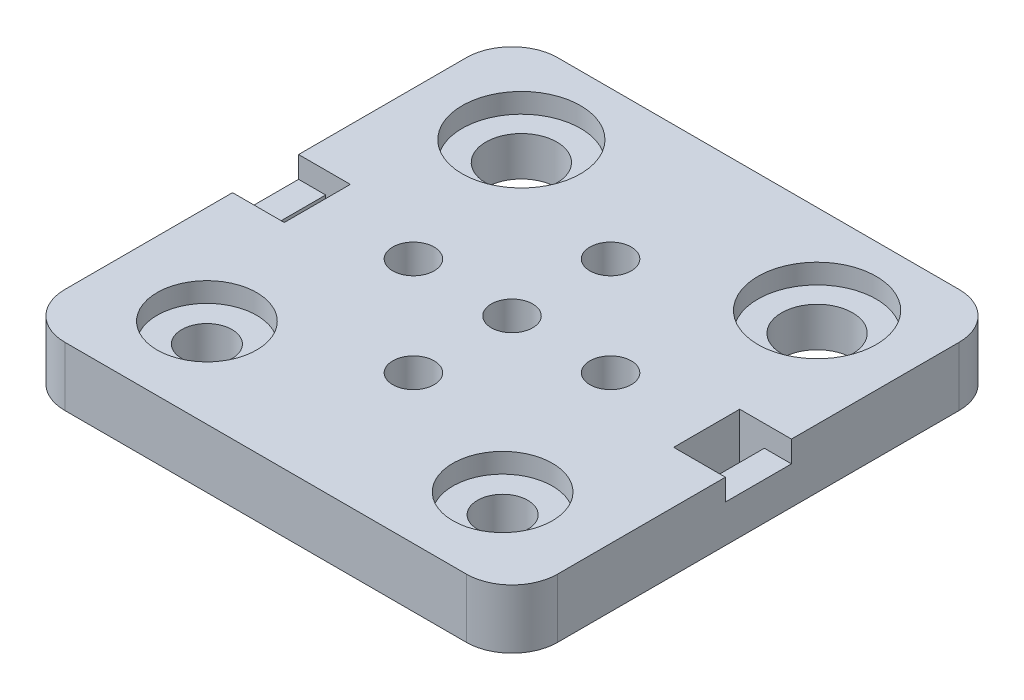
ISO-10303-21;
HEADER;
FILE_DESCRIPTION(('STEP AP214'),'2;1');
FILE_NAME('part.step','',(''),(''),'','','');
FILE_SCHEMA(('AUTOMOTIVE_DESIGN { 1 0 10303 214 1 1 1 1 }'));
ENDSEC;
DATA;
#1=APPLICATION_CONTEXT('core data for automotive mechanical design processes');
#2=APPLICATION_PROTOCOL_DEFINITION('international standard','automotive_design',2000,#1);
#3=PRODUCT_CONTEXT('',#1,'mechanical');
#4=PRODUCT('Part','Part','',(#3));
#5=PRODUCT_RELATED_PRODUCT_CATEGORY('part','',(#4));
#6=PRODUCT_DEFINITION_FORMATION('','',#4);
#7=PRODUCT_DEFINITION_CONTEXT('part definition',#1,'design');
#8=PRODUCT_DEFINITION('design','',#6,#7);
#9=PRODUCT_DEFINITION_SHAPE('','',#8);
#10=(LENGTH_UNIT() NAMED_UNIT(*) SI_UNIT(.MILLI.,.METRE.));
#11=(NAMED_UNIT(*) PLANE_ANGLE_UNIT() SI_UNIT($,.RADIAN.));
#12=(NAMED_UNIT(*) SI_UNIT($,.STERADIAN.) SOLID_ANGLE_UNIT());
#13=UNCERTAINTY_MEASURE_WITH_UNIT(LENGTH_MEASURE(1.E-05),#10,'distance_accuracy_value','');
#14=(GEOMETRIC_REPRESENTATION_CONTEXT(3) GLOBAL_UNCERTAINTY_ASSIGNED_CONTEXT((#13)) GLOBAL_UNIT_ASSIGNED_CONTEXT((#10,
#11,#12)) REPRESENTATION_CONTEXT('',''));
#15=CARTESIAN_POINT('',(0.,0.,0.));
#16=DIRECTION('',(0.,0.,1.));
#17=DIRECTION('',(1.,0.,0.));
#18=AXIS2_PLACEMENT_3D('',#15,#16,#17);
#19=CARTESIAN_POINT('',(-15.,6.,15.95));
#20=DIRECTION('',(0.,-1.,0.));
#21=DIRECTION('',(0.,0.,-1.));
#22=AXIS2_PLACEMENT_3D('',#19,#20,#21);
#23=CYLINDRICAL_SURFACE('',#22,2.55);
#24=CARTESIAN_POINT('',(-15.,0.,15.95));
#25=DIRECTION('',(0.,1.,0.));
#26=DIRECTION('',(0.,0.,-1.));
#27=AXIS2_PLACEMENT_3D('',#24,#25,#26);
#28=CIRCLE('',#27,2.55);
#29=CARTESIAN_POINT('',(-15.,0.,13.4));
#30=VERTEX_POINT('',#29);
#31=EDGE_CURVE('E332',#30,#30,#28,.T.);
#32=ORIENTED_EDGE('',*,*,#31,.F.);
#33=EDGE_LOOP('',(#32));
#34=FACE_BOUND('',#33,.T.);
#35=CARTESIAN_POINT('',(-15.,4.,15.95));
#36=DIRECTION('',(0.,1.,0.));
#37=DIRECTION('',(0.,0.,1.));
#38=AXIS2_PLACEMENT_3D('',#35,#36,#37);
#39=CIRCLE('',#38,2.55);
#40=CARTESIAN_POINT('',(-15.,4.,18.5));
#41=VERTEX_POINT('',#40);
#42=EDGE_CURVE('E47',#41,#41,#39,.T.);
#43=ORIENTED_EDGE('',*,*,#42,.T.);
#44=EDGE_LOOP('',(#43));
#45=FACE_BOUND('',#44,.T.);
#46=ADVANCED_FACE('F43',(#34,#45),#23,.F.);
#47=CARTESIAN_POINT('',(15.,6.,15.95));
#48=DIRECTION('',(0.,-1.,0.));
#49=DIRECTION('',(0.,0.,-1.));
#50=AXIS2_PLACEMENT_3D('',#47,#48,#49);
#51=CYLINDRICAL_SURFACE('',#50,2.55);
#52=CARTESIAN_POINT('',(15.,0.,15.95));
#53=DIRECTION('',(0.,1.,0.));
#54=DIRECTION('',(0.,0.,1.));
#55=AXIS2_PLACEMENT_3D('',#52,#53,#54);
#56=CIRCLE('',#55,2.55);
#57=CARTESIAN_POINT('',(15.,0.,18.5));
#58=VERTEX_POINT('',#57);
#59=EDGE_CURVE('E335',#58,#58,#56,.T.);
#60=ORIENTED_EDGE('',*,*,#59,.F.);
#61=EDGE_LOOP('',(#60));
#62=FACE_BOUND('',#61,.T.);
#63=CARTESIAN_POINT('',(15.,4.,15.95));
#64=DIRECTION('',(0.,1.,0.));
#65=DIRECTION('',(0.,0.,1.));
#66=AXIS2_PLACEMENT_3D('',#63,#64,#65);
#67=CIRCLE('',#66,2.55);
#68=CARTESIAN_POINT('',(15.,4.,18.5));
#69=VERTEX_POINT('',#68);
#70=EDGE_CURVE('E284',#69,#69,#67,.T.);
#71=ORIENTED_EDGE('',*,*,#70,.T.);
#72=EDGE_LOOP('',(#71));
#73=FACE_BOUND('',#72,.T.);
#74=ADVANCED_FACE('F408',(#62,#73),#51,.F.);
#75=CARTESIAN_POINT('',(15.,6.,-15.95));
#76=DIRECTION('',(0.,-1.,0.));
#77=DIRECTION('',(0.,0.,-1.));
#78=AXIS2_PLACEMENT_3D('',#75,#76,#77);
#79=CYLINDRICAL_SURFACE('',#78,3.6);
#80=CARTESIAN_POINT('',(15.,0.,-15.95));
#81=DIRECTION('',(0.,1.,0.));
#82=DIRECTION('',(0.,0.,-1.));
#83=AXIS2_PLACEMENT_3D('',#80,#81,#82);
#84=CIRCLE('',#83,3.6);
#85=CARTESIAN_POINT('',(15.,0.,-19.55));
#86=VERTEX_POINT('',#85);
#87=EDGE_CURVE('E338',#86,#86,#84,.T.);
#88=ORIENTED_EDGE('',*,*,#87,.F.);
#89=EDGE_LOOP('',(#88));
#90=FACE_BOUND('',#89,.T.);
#91=CARTESIAN_POINT('',(15.,4.,-15.95));
#92=DIRECTION('',(0.,1.,0.));
#93=DIRECTION('',(0.,0.,1.));
#94=AXIS2_PLACEMENT_3D('',#91,#92,#93);
#95=CIRCLE('',#94,3.6);
#96=CARTESIAN_POINT('',(15.,4.,-12.35));
#97=VERTEX_POINT('',#96);
#98=EDGE_CURVE('E291',#97,#97,#95,.T.);
#99=ORIENTED_EDGE('',*,*,#98,.T.);
#100=EDGE_LOOP('',(#99));
#101=FACE_BOUND('',#100,.T.);
#102=ADVANCED_FACE('F468',(#90,#101),#79,.F.);
#103=CARTESIAN_POINT('',(-15.,6.,-15.95));
#104=DIRECTION('',(0.,-1.,0.));
#105=DIRECTION('',(0.,0.,-1.));
#106=AXIS2_PLACEMENT_3D('',#103,#104,#105);
#107=CYLINDRICAL_SURFACE('',#106,3.6);
#108=CARTESIAN_POINT('',(-15.,0.,-15.95));
#109=DIRECTION('',(0.,1.,0.));
#110=DIRECTION('',(0.,0.,1.));
#111=AXIS2_PLACEMENT_3D('',#108,#109,#110);
#112=CIRCLE('',#111,3.6);
#113=CARTESIAN_POINT('',(-15.,0.,-12.35));
#114=VERTEX_POINT('',#113);
#115=EDGE_CURVE('E341',#114,#114,#112,.T.);
#116=ORIENTED_EDGE('',*,*,#115,.F.);
#117=EDGE_LOOP('',(#116));
#118=FACE_BOUND('',#117,.T.);
#119=CARTESIAN_POINT('',(-15.,4.,-15.95));
#120=DIRECTION('',(0.,1.,0.));
#121=DIRECTION('',(0.,0.,1.));
#122=AXIS2_PLACEMENT_3D('',#119,#120,#121);
#123=CIRCLE('',#122,3.6);
#124=CARTESIAN_POINT('',(-15.,4.,-12.35));
#125=VERTEX_POINT('',#124);
#126=EDGE_CURVE('E298',#125,#125,#123,.T.);
#127=ORIENTED_EDGE('',*,*,#126,.T.);
#128=EDGE_LOOP('',(#127));
#129=FACE_BOUND('',#128,.T.);
#130=ADVANCED_FACE('F427',(#118,#129),#107,.F.);
#131=CARTESIAN_POINT('',(-20.365,6.,-20.365));
#132=DIRECTION('',(0.,1.,0.));
#133=DIRECTION('',(0.,0.,1.));
#134=AXIS2_PLACEMENT_3D('',#131,#132,#133);
#135=PLANE('',#134);
#136=DIRECTION('',(-1.,0.,0.));
#137=VECTOR('',#136,1.);
#138=CARTESIAN_POINT('',(25.,6.,-3.35));
#139=LINE('',#138,#137);
#140=CARTESIAN_POINT('',(25.,6.,-3.35));
#141=VERTEX_POINT('',#140);
#142=CARTESIAN_POINT('',(19.75,6.,-3.35));
#143=VERTEX_POINT('',#142);
#144=EDGE_CURVE('E189',#141,#143,#139,.T.);
#145=ORIENTED_EDGE('',*,*,#144,.F.);
#146=DIRECTION('',(0.,0.,-1.));
#147=VECTOR('',#146,1.);
#148=CARTESIAN_POINT('',(25.,6.,20.365));
#149=LINE('',#148,#147);
#150=CARTESIAN_POINT('',(25.,6.,-20.365));
#151=VERTEX_POINT('',#150);
#152=EDGE_CURVE('E359',#141,#151,#149,.T.);
#153=ORIENTED_EDGE('',*,*,#152,.T.);
#154=CARTESIAN_POINT('',(20.365,6.,-20.365));
#155=DIRECTION('',(0.,1.,0.));
#156=DIRECTION('',(0.,0.,1.));
#157=AXIS2_PLACEMENT_3D('',#154,#155,#156);
#158=CIRCLE('',#157,4.635);
#159=CARTESIAN_POINT('',(20.365,6.,-25.));
#160=VERTEX_POINT('',#159);
#161=EDGE_CURVE('E363',#151,#160,#158,.T.);
#162=ORIENTED_EDGE('',*,*,#161,.T.);
#163=DIRECTION('',(-1.,0.,0.));
#164=VECTOR('',#163,1.);
#165=CARTESIAN_POINT('',(20.365,6.,-25.));
#166=LINE('',#165,#164);
#167=CARTESIAN_POINT('',(-20.365,6.,-25.));
#168=VERTEX_POINT('',#167);
#169=EDGE_CURVE('E365',#160,#168,#166,.T.);
#170=ORIENTED_EDGE('',*,*,#169,.T.);
#171=CARTESIAN_POINT('',(-20.365,6.,-20.365));
#172=DIRECTION('',(0.,1.,0.));
#173=DIRECTION('',(0.,0.,1.));
#174=AXIS2_PLACEMENT_3D('',#171,#172,#173);
#175=CIRCLE('',#174,4.635);
#176=CARTESIAN_POINT('',(-25.,6.,-20.365));
#177=VERTEX_POINT('',#176);
#178=EDGE_CURVE('E345',#168,#177,#175,.T.);
#179=ORIENTED_EDGE('',*,*,#178,.T.);
#180=DIRECTION('',(0.,0.,1.));
#181=VECTOR('',#180,1.);
#182=CARTESIAN_POINT('',(-25.,6.,20.365));
#183=LINE('',#182,#181);
#184=CARTESIAN_POINT('',(-25.,6.,-3.35));
#185=VERTEX_POINT('',#184);
#186=EDGE_CURVE('E350',#177,#185,#183,.T.);
#187=ORIENTED_EDGE('',*,*,#186,.T.);
#188=DIRECTION('',(-1.,0.,0.));
#189=VECTOR('',#188,1.);
#190=CARTESIAN_POINT('',(-25.,6.,-3.35));
#191=LINE('',#190,#189);
#192=CARTESIAN_POINT('',(-19.75,6.,-3.35));
#193=VERTEX_POINT('',#192);
#194=EDGE_CURVE('E255',#193,#185,#191,.T.);
#195=ORIENTED_EDGE('',*,*,#194,.F.);
#196=DIRECTION('',(0.,0.,-1.));
#197=VECTOR('',#196,1.);
#198=CARTESIAN_POINT('',(-19.75,6.,-3.35));
#199=LINE('',#198,#197);
#200=CARTESIAN_POINT('',(-19.75,6.,3.35));
#201=VERTEX_POINT('',#200);
#202=EDGE_CURVE('E263',#201,#193,#199,.T.);
#203=ORIENTED_EDGE('',*,*,#202,.F.);
#204=DIRECTION('',(1.,0.,0.));
#205=VECTOR('',#204,1.);
#206=CARTESIAN_POINT('',(-25.,6.,3.35));
#207=LINE('',#206,#205);
#208=CARTESIAN_POINT('',(-25.,6.,3.35));
#209=VERTEX_POINT('',#208);
#210=EDGE_CURVE('E246',#209,#201,#207,.T.);
#211=ORIENTED_EDGE('',*,*,#210,.F.);
#212=CARTESIAN_POINT('',(-25.,6.,20.365));
#213=VERTEX_POINT('',#212);
#214=EDGE_CURVE('E348',#209,#213,#183,.T.);
#215=ORIENTED_EDGE('',*,*,#214,.T.);
#216=CARTESIAN_POINT('',(-20.365,6.,20.365));
#217=DIRECTION('',(0.,1.,0.));
#218=DIRECTION('',(0.,0.,-1.));
#219=AXIS2_PLACEMENT_3D('',#216,#217,#218);
#220=CIRCLE('',#219,4.635);
#221=CARTESIAN_POINT('',(-20.365,6.,25.));
#222=VERTEX_POINT('',#221);
#223=EDGE_CURVE('E353',#213,#222,#220,.T.);
#224=ORIENTED_EDGE('',*,*,#223,.T.);
#225=DIRECTION('',(1.,0.,0.));
#226=VECTOR('',#225,1.);
#227=CARTESIAN_POINT('',(20.365,6.,25.));
#228=LINE('',#227,#226);
#229=CARTESIAN_POINT('',(20.365,6.,25.));
#230=VERTEX_POINT('',#229);
#231=EDGE_CURVE('E355',#222,#230,#228,.T.);
#232=ORIENTED_EDGE('',*,*,#231,.T.);
#233=CARTESIAN_POINT('',(20.365,6.,20.365));
#234=DIRECTION('',(0.,1.,0.));
#235=DIRECTION('',(0.,0.,1.));
#236=AXIS2_PLACEMENT_3D('',#233,#234,#235);
#237=CIRCLE('',#236,4.635);
#238=CARTESIAN_POINT('',(25.,6.,20.365));
#239=VERTEX_POINT('',#238);
#240=EDGE_CURVE('E357',#230,#239,#237,.T.);
#241=ORIENTED_EDGE('',*,*,#240,.T.);
#242=CARTESIAN_POINT('',(25.,6.,3.35));
#243=VERTEX_POINT('',#242);
#244=EDGE_CURVE('E360',#239,#243,#149,.T.);
#245=ORIENTED_EDGE('',*,*,#244,.T.);
#246=DIRECTION('',(1.,0.,0.));
#247=VECTOR('',#246,1.);
#248=CARTESIAN_POINT('',(25.,6.,3.35));
#249=LINE('',#248,#247);
#250=CARTESIAN_POINT('',(19.75,6.,3.35));
#251=VERTEX_POINT('',#250);
#252=EDGE_CURVE('E236',#251,#243,#249,.T.);
#253=ORIENTED_EDGE('',*,*,#252,.F.);
#254=DIRECTION('',(0.,0.,1.));
#255=VECTOR('',#254,1.);
#256=CARTESIAN_POINT('',(19.75,6.,-3.35));
#257=LINE('',#256,#255);
#258=EDGE_CURVE('E241',#143,#251,#257,.T.);
#259=ORIENTED_EDGE('',*,*,#258,.F.);
#260=EDGE_LOOP('',(#145,#153,#162,#170,#179,#187,#195,#203,#211,#215,#224,#232,#241,#245,#253,#259));
#261=FACE_BOUND('',#260,.T.);
#262=CARTESIAN_POINT('',(-15.,6.,15.95));
#263=DIRECTION('',(0.,1.,0.));
#264=DIRECTION('',(0.,0.,1.));
#265=AXIS2_PLACEMENT_3D('',#262,#263,#264);
#266=CIRCLE('',#265,5.05);
#267=CARTESIAN_POINT('',(-15.,6.,21.));
#268=VERTEX_POINT('',#267);
#269=EDGE_CURVE('E270',#268,#268,#266,.T.);
#270=ORIENTED_EDGE('',*,*,#269,.F.);
#271=EDGE_LOOP('',(#270));
#272=FACE_BOUND('',#271,.T.);
#273=CARTESIAN_POINT('',(15.,6.,15.95));
#274=DIRECTION('',(0.,1.,0.));
#275=DIRECTION('',(0.,0.,1.));
#276=AXIS2_PLACEMENT_3D('',#273,#274,#275);
#277=CIRCLE('',#276,5.05);
#278=CARTESIAN_POINT('',(15.,6.,21.));
#279=VERTEX_POINT('',#278);
#280=EDGE_CURVE('E285',#279,#279,#277,.T.);
#281=ORIENTED_EDGE('',*,*,#280,.F.);
#282=EDGE_LOOP('',(#281));
#283=FACE_BOUND('',#282,.T.);
#284=CARTESIAN_POINT('',(15.,6.,-15.95));
#285=DIRECTION('',(0.,1.,0.));
#286=DIRECTION('',(0.,0.,1.));
#287=AXIS2_PLACEMENT_3D('',#284,#285,#286);
#288=CIRCLE('',#287,6.00000000000001);
#289=CARTESIAN_POINT('',(15.,6.,-9.94999999999998));
#290=VERTEX_POINT('',#289);
#291=EDGE_CURVE('E292',#290,#290,#288,.T.);
#292=ORIENTED_EDGE('',*,*,#291,.F.);
#293=EDGE_LOOP('',(#292));
#294=FACE_BOUND('',#293,.T.);
#295=CARTESIAN_POINT('',(-15.,6.,-15.95));
#296=DIRECTION('',(0.,1.,0.));
#297=DIRECTION('',(0.,0.,1.));
#298=AXIS2_PLACEMENT_3D('',#295,#296,#297);
#299=CIRCLE('',#298,6.);
#300=CARTESIAN_POINT('',(-15.,6.,-9.94999999999998));
#301=VERTEX_POINT('',#300);
#302=EDGE_CURVE('E299',#301,#301,#299,.T.);
#303=ORIENTED_EDGE('',*,*,#302,.F.);
#304=EDGE_LOOP('',(#303));
#305=FACE_BOUND('',#304,.T.);
#306=CARTESIAN_POINT('',(0.,6.,-10.));
#307=DIRECTION('',(0.,1.,0.));
#308=DIRECTION('',(0.,0.,1.));
#309=AXIS2_PLACEMENT_3D('',#306,#307,#308);
#310=CIRCLE('',#309,2.1);
#311=CARTESIAN_POINT('',(0.,6.,-7.9));
#312=VERTEX_POINT('',#311);
#313=EDGE_CURVE('E302',#312,#312,#310,.T.);
#314=ORIENTED_EDGE('',*,*,#313,.F.);
#315=EDGE_LOOP('',(#314));
#316=FACE_BOUND('',#315,.T.);
#317=CARTESIAN_POINT('',(-10.,6.,0.));
#318=DIRECTION('',(0.,1.,0.));
#319=DIRECTION('',(0.,0.,1.));
#320=AXIS2_PLACEMENT_3D('',#317,#318,#319);
#321=CIRCLE('',#320,2.1);
#322=CARTESIAN_POINT('',(-10.,6.,2.1));
#323=VERTEX_POINT('',#322);
#324=EDGE_CURVE('E308',#323,#323,#321,.T.);
#325=ORIENTED_EDGE('',*,*,#324,.F.);
#326=EDGE_LOOP('',(#325));
#327=FACE_BOUND('',#326,.T.);
#328=CARTESIAN_POINT('',(0.,6.,0.));
#329=DIRECTION('',(0.,1.,0.));
#330=DIRECTION('',(0.,0.,1.));
#331=AXIS2_PLACEMENT_3D('',#328,#329,#330);
#332=CIRCLE('',#331,2.1);
#333=CARTESIAN_POINT('',(0.,6.,2.1));
#334=VERTEX_POINT('',#333);
#335=EDGE_CURVE('E314',#334,#334,#332,.T.);
#336=ORIENTED_EDGE('',*,*,#335,.F.);
#337=EDGE_LOOP('',(#336));
#338=FACE_BOUND('',#337,.T.);
#339=CARTESIAN_POINT('',(0.,6.,10.));
#340=DIRECTION('',(0.,1.,0.));
#341=DIRECTION('',(0.,0.,1.));
#342=AXIS2_PLACEMENT_3D('',#339,#340,#341);
#343=CIRCLE('',#342,2.1);
#344=CARTESIAN_POINT('',(0.,6.,12.1));
#345=VERTEX_POINT('',#344);
#346=EDGE_CURVE('E320',#345,#345,#343,.T.);
#347=ORIENTED_EDGE('',*,*,#346,.F.);
#348=EDGE_LOOP('',(#347));
#349=FACE_BOUND('',#348,.T.);
#350=CARTESIAN_POINT('',(10.,6.,0.));
#351=DIRECTION('',(0.,1.,0.));
#352=DIRECTION('',(0.,0.,1.));
#353=AXIS2_PLACEMENT_3D('',#350,#351,#352);
#354=CIRCLE('',#353,2.1);
#355=CARTESIAN_POINT('',(10.,6.,2.1));
#356=VERTEX_POINT('',#355);
#357=EDGE_CURVE('E326',#356,#356,#354,.T.);
#358=ORIENTED_EDGE('',*,*,#357,.F.);
#359=EDGE_LOOP('',(#358));
#360=FACE_BOUND('',#359,.T.);
#361=ADVANCED_FACE('F424',(#261,#272,#283,#294,#305,#316,#327,#338,#349,#360),#135,.T.);
#362=CARTESIAN_POINT('',(-20.365,0.,-20.365));
#363=DIRECTION('',(0.,1.,0.));
#364=DIRECTION('',(0.,0.,1.));
#365=AXIS2_PLACEMENT_3D('',#362,#363,#364);
#366=PLANE('',#365);
#367=DIRECTION('',(0.,0.,-1.));
#368=VECTOR('',#367,1.);
#369=CARTESIAN_POINT('',(22.25,0.,-3.35));
#370=LINE('',#369,#368);
#371=CARTESIAN_POINT('',(22.25,0.,3.35));
#372=VERTEX_POINT('',#371);
#373=CARTESIAN_POINT('',(22.25,0.,-3.35));
#374=VERTEX_POINT('',#373);
#375=EDGE_CURVE('E203',#372,#374,#370,.T.);
#376=ORIENTED_EDGE('',*,*,#375,.T.);
#377=DIRECTION('',(-1.,0.,0.));
#378=VECTOR('',#377,1.);
#379=CARTESIAN_POINT('',(19.75,0.,-3.35));
#380=LINE('',#379,#378);
#381=CARTESIAN_POINT('',(19.75,0.,-3.35));
#382=VERTEX_POINT('',#381);
#383=EDGE_CURVE('E186',#374,#382,#380,.T.);
#384=ORIENTED_EDGE('',*,*,#383,.T.);
#385=DIRECTION('',(0.,0.,1.));
#386=VECTOR('',#385,1.);
#387=CARTESIAN_POINT('',(19.75,0.,-3.35));
#388=LINE('',#387,#386);
#389=CARTESIAN_POINT('',(19.75,0.,3.35));
#390=VERTEX_POINT('',#389);
#391=EDGE_CURVE('E194',#382,#390,#388,.T.);
#392=ORIENTED_EDGE('',*,*,#391,.T.);
#393=DIRECTION('',(1.,0.,0.));
#394=VECTOR('',#393,1.);
#395=CARTESIAN_POINT('',(19.75,0.,3.35));
#396=LINE('',#395,#394);
#397=EDGE_CURVE('E198',#390,#372,#396,.T.);
#398=ORIENTED_EDGE('',*,*,#397,.T.);
#399=EDGE_LOOP('',(#376,#384,#392,#398));
#400=FACE_BOUND('',#399,.T.);
#401=DIRECTION('',(1.,0.,0.));
#402=VECTOR('',#401,1.);
#403=CARTESIAN_POINT('',(-19.75,0.,3.35));
#404=LINE('',#403,#402);
#405=CARTESIAN_POINT('',(-22.25,0.,3.35));
#406=VERTEX_POINT('',#405);
#407=CARTESIAN_POINT('',(-19.75,0.,3.35));
#408=VERTEX_POINT('',#407);
#409=EDGE_CURVE('E223',#406,#408,#404,.T.);
#410=ORIENTED_EDGE('',*,*,#409,.T.);
#411=DIRECTION('',(0.,0.,-1.));
#412=VECTOR('',#411,1.);
#413=CARTESIAN_POINT('',(-19.75,0.,-3.35));
#414=LINE('',#413,#412);
#415=CARTESIAN_POINT('',(-19.75,0.,-3.35));
#416=VERTEX_POINT('',#415);
#417=EDGE_CURVE('E216',#408,#416,#414,.T.);
#418=ORIENTED_EDGE('',*,*,#417,.T.);
#419=DIRECTION('',(-1.,0.,0.));
#420=VECTOR('',#419,1.);
#421=CARTESIAN_POINT('',(-19.75,0.,-3.35));
#422=LINE('',#421,#420);
#423=CARTESIAN_POINT('',(-22.25,0.,-3.35));
#424=VERTEX_POINT('',#423);
#425=EDGE_CURVE('E219',#416,#424,#422,.T.);
#426=ORIENTED_EDGE('',*,*,#425,.T.);
#427=DIRECTION('',(0.,0.,1.));
#428=VECTOR('',#427,1.);
#429=CARTESIAN_POINT('',(-22.25,0.,-3.35));
#430=LINE('',#429,#428);
#431=EDGE_CURVE('E68',#424,#406,#430,.T.);
#432=ORIENTED_EDGE('',*,*,#431,.T.);
#433=EDGE_LOOP('',(#410,#418,#426,#432));
#434=FACE_BOUND('',#433,.T.);
#435=CARTESIAN_POINT('',(0.,0.,-10.));
#436=DIRECTION('',(0.,1.,0.));
#437=DIRECTION('',(0.,0.,1.));
#438=AXIS2_PLACEMENT_3D('',#435,#436,#437);
#439=CIRCLE('',#438,2.1);
#440=CARTESIAN_POINT('',(0.,0.,-7.9));
#441=VERTEX_POINT('',#440);
#442=EDGE_CURVE('E305',#441,#441,#439,.T.);
#443=ORIENTED_EDGE('',*,*,#442,.T.);
#444=EDGE_LOOP('',(#443));
#445=FACE_BOUND('',#444,.T.);
#446=CARTESIAN_POINT('',(-10.,0.,0.));
#447=DIRECTION('',(0.,1.,0.));
#448=DIRECTION('',(0.,0.,1.));
#449=AXIS2_PLACEMENT_3D('',#446,#447,#448);
#450=CIRCLE('',#449,2.1);
#451=CARTESIAN_POINT('',(-10.,0.,2.1));
#452=VERTEX_POINT('',#451);
#453=EDGE_CURVE('E311',#452,#452,#450,.T.);
#454=ORIENTED_EDGE('',*,*,#453,.T.);
#455=EDGE_LOOP('',(#454));
#456=FACE_BOUND('',#455,.T.);
#457=CARTESIAN_POINT('',(0.,0.,0.));
#458=DIRECTION('',(0.,1.,0.));
#459=DIRECTION('',(0.,0.,1.));
#460=AXIS2_PLACEMENT_3D('',#457,#458,#459);
#461=CIRCLE('',#460,2.1);
#462=CARTESIAN_POINT('',(0.,0.,2.1));
#463=VERTEX_POINT('',#462);
#464=EDGE_CURVE('E317',#463,#463,#461,.T.);
#465=ORIENTED_EDGE('',*,*,#464,.T.);
#466=EDGE_LOOP('',(#465));
#467=FACE_BOUND('',#466,.T.);
#468=CARTESIAN_POINT('',(0.,0.,10.));
#469=DIRECTION('',(0.,1.,0.));
#470=DIRECTION('',(0.,0.,1.));
#471=AXIS2_PLACEMENT_3D('',#468,#469,#470);
#472=CIRCLE('',#471,2.1);
#473=CARTESIAN_POINT('',(0.,0.,12.1));
#474=VERTEX_POINT('',#473);
#475=EDGE_CURVE('E323',#474,#474,#472,.T.);
#476=ORIENTED_EDGE('',*,*,#475,.T.);
#477=EDGE_LOOP('',(#476));
#478=FACE_BOUND('',#477,.T.);
#479=CARTESIAN_POINT('',(10.,0.,0.));
#480=DIRECTION('',(0.,1.,0.));
#481=DIRECTION('',(0.,0.,1.));
#482=AXIS2_PLACEMENT_3D('',#479,#480,#481);
#483=CIRCLE('',#482,2.1);
#484=CARTESIAN_POINT('',(10.,0.,2.1));
#485=VERTEX_POINT('',#484);
#486=EDGE_CURVE('E329',#485,#485,#483,.T.);
#487=ORIENTED_EDGE('',*,*,#486,.T.);
#488=EDGE_LOOP('',(#487));
#489=FACE_BOUND('',#488,.T.);
#490=ORIENTED_EDGE('',*,*,#59,.T.);
#491=EDGE_LOOP('',(#490));
#492=FACE_BOUND('',#491,.T.);
#493=ORIENTED_EDGE('',*,*,#115,.T.);
#494=EDGE_LOOP('',(#493));
#495=FACE_BOUND('',#494,.T.);
#496=CARTESIAN_POINT('',(-20.365,0.,-20.365));
#497=DIRECTION('',(0.,1.,0.));
#498=DIRECTION('',(0.,0.,1.));
#499=AXIS2_PLACEMENT_3D('',#496,#497,#498);
#500=CIRCLE('',#499,4.635);
#501=CARTESIAN_POINT('',(-20.365,0.,-25.));
#502=VERTEX_POINT('',#501);
#503=CARTESIAN_POINT('',(-25.,0.,-20.365));
#504=VERTEX_POINT('',#503);
#505=EDGE_CURVE('E344',#502,#504,#500,.T.);
#506=ORIENTED_EDGE('',*,*,#505,.F.);
#507=DIRECTION('',(-1.,0.,0.));
#508=VECTOR('',#507,1.);
#509=CARTESIAN_POINT('',(20.365,0.,-25.));
#510=LINE('',#509,#508);
#511=CARTESIAN_POINT('',(20.365,0.,-25.));
#512=VERTEX_POINT('',#511);
#513=EDGE_CURVE('E349',#512,#502,#510,.T.);
#514=ORIENTED_EDGE('',*,*,#513,.F.);
#515=CARTESIAN_POINT('',(20.365,0.,-20.365));
#516=DIRECTION('',(0.,1.,0.));
#517=DIRECTION('',(0.,0.,1.));
#518=AXIS2_PLACEMENT_3D('',#515,#516,#517);
#519=CIRCLE('',#518,4.635);
#520=CARTESIAN_POINT('',(25.,0.,-20.365));
#521=VERTEX_POINT('',#520);
#522=EDGE_CURVE('E380',#521,#512,#519,.T.);
#523=ORIENTED_EDGE('',*,*,#522,.F.);
#524=DIRECTION('',(0.,0.,-1.));
#525=VECTOR('',#524,1.);
#526=CARTESIAN_POINT('',(25.,0.,20.365));
#527=LINE('',#526,#525);
#528=CARTESIAN_POINT('',(25.,0.,20.365));
#529=VERTEX_POINT('',#528);
#530=EDGE_CURVE('E378',#529,#521,#527,.T.);
#531=ORIENTED_EDGE('',*,*,#530,.F.);
#532=CARTESIAN_POINT('',(20.365,0.,20.365));
#533=DIRECTION('',(0.,1.,0.));
#534=DIRECTION('',(0.,0.,1.));
#535=AXIS2_PLACEMENT_3D('',#532,#533,#534);
#536=CIRCLE('',#535,4.635);
#537=CARTESIAN_POINT('',(20.365,0.,25.));
#538=VERTEX_POINT('',#537);
#539=EDGE_CURVE('E376',#538,#529,#536,.T.);
#540=ORIENTED_EDGE('',*,*,#539,.F.);
#541=DIRECTION('',(1.,0.,0.));
#542=VECTOR('',#541,1.);
#543=CARTESIAN_POINT('',(20.365,0.,25.));
#544=LINE('',#543,#542);
#545=CARTESIAN_POINT('',(-20.365,0.,25.));
#546=VERTEX_POINT('',#545);
#547=EDGE_CURVE('E374',#546,#538,#544,.T.);
#548=ORIENTED_EDGE('',*,*,#547,.F.);
#549=CARTESIAN_POINT('',(-20.365,0.,20.365));
#550=DIRECTION('',(0.,1.,0.));
#551=DIRECTION('',(0.,0.,-1.));
#552=AXIS2_PLACEMENT_3D('',#549,#550,#551);
#553=CIRCLE('',#552,4.635);
#554=CARTESIAN_POINT('',(-25.,0.,20.365));
#555=VERTEX_POINT('',#554);
#556=EDGE_CURVE('E372',#555,#546,#553,.T.);
#557=ORIENTED_EDGE('',*,*,#556,.F.);
#558=DIRECTION('',(0.,0.,1.));
#559=VECTOR('',#558,1.);
#560=CARTESIAN_POINT('',(-25.,0.,20.365));
#561=LINE('',#560,#559);
#562=EDGE_CURVE('E370',#504,#555,#561,.T.);
#563=ORIENTED_EDGE('',*,*,#562,.F.);
#564=EDGE_LOOP('',(#506,#514,#523,#531,#540,#548,#557,#563));
#565=FACE_BOUND('',#564,.T.);
#566=ORIENTED_EDGE('',*,*,#87,.T.);
#567=EDGE_LOOP('',(#566));
#568=FACE_BOUND('',#567,.T.);
#569=ORIENTED_EDGE('',*,*,#31,.T.);
#570=EDGE_LOOP('',(#569));
#571=FACE_BOUND('',#570,.T.);
#572=ADVANCED_FACE('F200',(#400,#434,#445,#456,#467,#478,#489,#492,#495,#565,#568,#571),#366,.F.);
#573=CARTESIAN_POINT('',(-20.365,6.,-20.365));
#574=DIRECTION('',(0.,-1.,0.));
#575=DIRECTION('',(0.,0.,-1.));
#576=AXIS2_PLACEMENT_3D('',#573,#574,#575);
#577=CYLINDRICAL_SURFACE('',#576,4.635);
#578=ORIENTED_EDGE('',*,*,#505,.T.);
#579=DIRECTION('',(0.,-1.,0.));
#580=VECTOR('',#579,1.);
#581=CARTESIAN_POINT('',(-25.,6.,-20.365));
#582=LINE('',#581,#580);
#583=EDGE_CURVE('E11',#177,#504,#582,.T.);
#584=ORIENTED_EDGE('',*,*,#583,.F.);
#585=ORIENTED_EDGE('',*,*,#178,.F.);
#586=DIRECTION('',(0.,-1.,0.));
#587=VECTOR('',#586,1.);
#588=CARTESIAN_POINT('',(-20.365,6.,-25.));
#589=LINE('',#588,#587);
#590=EDGE_CURVE('E367',#168,#502,#589,.T.);
#591=ORIENTED_EDGE('',*,*,#590,.T.);
#592=EDGE_LOOP('',(#578,#584,#585,#591));
#593=FACE_BOUND('',#592,.T.);
#594=ADVANCED_FACE('F45',(#593),#577,.T.);
#595=CARTESIAN_POINT('',(-25.,6.,20.365));
#596=DIRECTION('',(1.,0.,0.));
#597=DIRECTION('',(0.,0.,-1.));
#598=AXIS2_PLACEMENT_3D('',#595,#596,#597);
#599=PLANE('',#598);
#600=DIRECTION('',(0.,0.,1.));
#601=VECTOR('',#600,1.);
#602=CARTESIAN_POINT('',(-25.,3.82,-3.35));
#603=LINE('',#602,#601);
#604=CARTESIAN_POINT('',(-25.,3.82,-3.35));
#605=VERTEX_POINT('',#604);
#606=CARTESIAN_POINT('',(-25.,3.82,3.35));
#607=VERTEX_POINT('',#606);
#608=EDGE_CURVE('E251',#605,#607,#603,.T.);
#609=ORIENTED_EDGE('',*,*,#608,.F.);
#610=DIRECTION('',(0.,1.,0.));
#611=VECTOR('',#610,1.);
#612=CARTESIAN_POINT('',(-25.,3.82,-3.35));
#613=LINE('',#612,#611);
#614=EDGE_CURVE('E267',#605,#185,#613,.T.);
#615=ORIENTED_EDGE('',*,*,#614,.T.);
#616=ORIENTED_EDGE('',*,*,#186,.F.);
#617=ORIENTED_EDGE('',*,*,#583,.T.);
#618=ORIENTED_EDGE('',*,*,#562,.T.);
#619=DIRECTION('',(0.,-1.,0.));
#620=VECTOR('',#619,1.);
#621=CARTESIAN_POINT('',(-25.,6.,20.365));
#622=LINE('',#621,#620);
#623=EDGE_CURVE('E52',#213,#555,#622,.T.);
#624=ORIENTED_EDGE('',*,*,#623,.F.);
#625=ORIENTED_EDGE('',*,*,#214,.F.);
#626=DIRECTION('',(0.,1.,0.));
#627=VECTOR('',#626,1.);
#628=CARTESIAN_POINT('',(-25.,3.82,3.35));
#629=LINE('',#628,#627);
#630=EDGE_CURVE('E260',#607,#209,#629,.T.);
#631=ORIENTED_EDGE('',*,*,#630,.F.);
#632=EDGE_LOOP('',(#609,#615,#616,#617,#618,#624,#625,#631));
#633=FACE_BOUND('',#632,.T.);
#634=ADVANCED_FACE('F499',(#633),#599,.F.);
#635=CARTESIAN_POINT('',(-20.365,6.,20.365));
#636=DIRECTION('',(0.,-1.,0.));
#637=DIRECTION('',(0.,0.,-1.));
#638=AXIS2_PLACEMENT_3D('',#635,#636,#637);
#639=CYLINDRICAL_SURFACE('',#638,4.635);
#640=ORIENTED_EDGE('',*,*,#556,.T.);
#641=DIRECTION('',(0.,-1.,0.));
#642=VECTOR('',#641,1.);
#643=CARTESIAN_POINT('',(-20.365,6.,25.));
#644=LINE('',#643,#642);
#645=EDGE_CURVE('E397',#222,#546,#644,.T.);
#646=ORIENTED_EDGE('',*,*,#645,.F.);
#647=ORIENTED_EDGE('',*,*,#223,.F.);
#648=ORIENTED_EDGE('',*,*,#623,.T.);
#649=EDGE_LOOP('',(#640,#646,#647,#648));
#650=FACE_BOUND('',#649,.T.);
#651=ADVANCED_FACE('F496',(#650),#639,.T.);
#652=CARTESIAN_POINT('',(20.365,6.,25.));
#653=DIRECTION('',(0.,0.,-1.));
#654=DIRECTION('',(-1.,0.,0.));
#655=AXIS2_PLACEMENT_3D('',#652,#653,#654);
#656=PLANE('',#655);
#657=ORIENTED_EDGE('',*,*,#547,.T.);
#658=DIRECTION('',(0.,-1.,0.));
#659=VECTOR('',#658,1.);
#660=CARTESIAN_POINT('',(20.365,6.,25.));
#661=LINE('',#660,#659);
#662=EDGE_CURVE('E394',#230,#538,#661,.T.);
#663=ORIENTED_EDGE('',*,*,#662,.F.);
#664=ORIENTED_EDGE('',*,*,#231,.F.);
#665=ORIENTED_EDGE('',*,*,#645,.T.);
#666=EDGE_LOOP('',(#657,#663,#664,#665));
#667=FACE_BOUND('',#666,.T.);
#668=ADVANCED_FACE('F492',(#667),#656,.F.);
#669=CARTESIAN_POINT('',(20.365,6.,20.365));
#670=DIRECTION('',(0.,-1.,0.));
#671=DIRECTION('',(0.,0.,-1.));
#672=AXIS2_PLACEMENT_3D('',#669,#670,#671);
#673=CYLINDRICAL_SURFACE('',#672,4.635);
#674=ORIENTED_EDGE('',*,*,#539,.T.);
#675=DIRECTION('',(0.,-1.,0.));
#676=VECTOR('',#675,1.);
#677=CARTESIAN_POINT('',(25.,6.,20.365));
#678=LINE('',#677,#676);
#679=EDGE_CURVE('E391',#239,#529,#678,.T.);
#680=ORIENTED_EDGE('',*,*,#679,.F.);
#681=ORIENTED_EDGE('',*,*,#240,.F.);
#682=ORIENTED_EDGE('',*,*,#662,.T.);
#683=EDGE_LOOP('',(#674,#680,#681,#682));
#684=FACE_BOUND('',#683,.T.);
#685=ADVANCED_FACE('F488',(#684),#673,.T.);
#686=CARTESIAN_POINT('',(25.,6.,20.365));
#687=DIRECTION('',(-1.,0.,0.));
#688=DIRECTION('',(0.,0.,1.));
#689=AXIS2_PLACEMENT_3D('',#686,#687,#688);
#690=PLANE('',#689);
#691=ORIENTED_EDGE('',*,*,#152,.F.);
#692=DIRECTION('',(0.,1.,0.));
#693=VECTOR('',#692,1.);
#694=CARTESIAN_POINT('',(25.,3.82,-3.35));
#695=LINE('',#694,#693);
#696=CARTESIAN_POINT('',(25.,3.82,-3.35));
#697=VERTEX_POINT('',#696);
#698=EDGE_CURVE('E244',#697,#141,#695,.T.);
#699=ORIENTED_EDGE('',*,*,#698,.F.);
#700=DIRECTION('',(0.,0.,-1.));
#701=VECTOR('',#700,1.);
#702=CARTESIAN_POINT('',(25.,3.82,-3.35));
#703=LINE('',#702,#701);
#704=CARTESIAN_POINT('',(25.,3.82,3.35));
#705=VERTEX_POINT('',#704);
#706=EDGE_CURVE('E191',#705,#697,#703,.T.);
#707=ORIENTED_EDGE('',*,*,#706,.F.);
#708=DIRECTION('',(0.,1.,0.));
#709=VECTOR('',#708,1.);
#710=CARTESIAN_POINT('',(25.,3.82,3.35));
#711=LINE('',#710,#709);
#712=EDGE_CURVE('E247',#705,#243,#711,.T.);
#713=ORIENTED_EDGE('',*,*,#712,.T.);
#714=ORIENTED_EDGE('',*,*,#244,.F.);
#715=ORIENTED_EDGE('',*,*,#679,.T.);
#716=ORIENTED_EDGE('',*,*,#530,.T.);
#717=DIRECTION('',(0.,-1.,0.));
#718=VECTOR('',#717,1.);
#719=CARTESIAN_POINT('',(25.,6.,-20.365));
#720=LINE('',#719,#718);
#721=EDGE_CURVE('E388',#151,#521,#720,.T.);
#722=ORIENTED_EDGE('',*,*,#721,.F.);
#723=EDGE_LOOP('',(#691,#699,#707,#713,#714,#715,#716,#722));
#724=FACE_BOUND('',#723,.T.);
#725=ADVANCED_FACE('F484',(#724),#690,.F.);
#726=CARTESIAN_POINT('',(20.365,6.,-20.365));
#727=DIRECTION('',(0.,-1.,0.));
#728=DIRECTION('',(0.,0.,-1.));
#729=AXIS2_PLACEMENT_3D('',#726,#727,#728);
#730=CYLINDRICAL_SURFACE('',#729,4.635);
#731=ORIENTED_EDGE('',*,*,#522,.T.);
#732=DIRECTION('',(0.,-1.,0.));
#733=VECTOR('',#732,1.);
#734=CARTESIAN_POINT('',(20.365,6.,-25.));
#735=LINE('',#734,#733);
#736=EDGE_CURVE('E385',#160,#512,#735,.T.);
#737=ORIENTED_EDGE('',*,*,#736,.F.);
#738=ORIENTED_EDGE('',*,*,#161,.F.);
#739=ORIENTED_EDGE('',*,*,#721,.T.);
#740=EDGE_LOOP('',(#731,#737,#738,#739));
#741=FACE_BOUND('',#740,.T.);
#742=ADVANCED_FACE('F457',(#741),#730,.T.);
#743=CARTESIAN_POINT('',(20.365,6.,-25.));
#744=DIRECTION('',(0.,0.,1.));
#745=DIRECTION('',(1.,0.,0.));
#746=AXIS2_PLACEMENT_3D('',#743,#744,#745);
#747=PLANE('',#746);
#748=ORIENTED_EDGE('',*,*,#513,.T.);
#749=ORIENTED_EDGE('',*,*,#590,.F.);
#750=ORIENTED_EDGE('',*,*,#169,.F.);
#751=ORIENTED_EDGE('',*,*,#736,.T.);
#752=EDGE_LOOP('',(#748,#749,#750,#751));
#753=FACE_BOUND('',#752,.T.);
#754=ADVANCED_FACE('F447',(#753),#747,.F.);
#755=CARTESIAN_POINT('',(10.,6.,0.));
#756=DIRECTION('',(0.,1.,0.));
#757=DIRECTION('',(0.,0.,1.));
#758=AXIS2_PLACEMENT_3D('',#755,#756,#757);
#759=CYLINDRICAL_SURFACE('',#758,2.1);
#760=ORIENTED_EDGE('',*,*,#486,.F.);
#761=EDGE_LOOP('',(#760));
#762=FACE_BOUND('',#761,.T.);
#763=ORIENTED_EDGE('',*,*,#357,.T.);
#764=EDGE_LOOP('',(#763));
#765=FACE_BOUND('',#764,.T.);
#766=ADVANCED_FACE('F444',(#762,#765),#759,.F.);
#767=CARTESIAN_POINT('',(0.,6.,10.));
#768=DIRECTION('',(0.,1.,0.));
#769=DIRECTION('',(0.,0.,1.));
#770=AXIS2_PLACEMENT_3D('',#767,#768,#769);
#771=CYLINDRICAL_SURFACE('',#770,2.1);
#772=ORIENTED_EDGE('',*,*,#475,.F.);
#773=EDGE_LOOP('',(#772));
#774=FACE_BOUND('',#773,.T.);
#775=ORIENTED_EDGE('',*,*,#346,.T.);
#776=EDGE_LOOP('',(#775));
#777=FACE_BOUND('',#776,.T.);
#778=ADVANCED_FACE('F446',(#774,#777),#771,.F.);
#779=CARTESIAN_POINT('',(0.,6.,0.));
#780=DIRECTION('',(0.,1.,0.));
#781=DIRECTION('',(0.,0.,1.));
#782=AXIS2_PLACEMENT_3D('',#779,#780,#781);
#783=CYLINDRICAL_SURFACE('',#782,2.1);
#784=ORIENTED_EDGE('',*,*,#464,.F.);
#785=EDGE_LOOP('',(#784));
#786=FACE_BOUND('',#785,.T.);
#787=ORIENTED_EDGE('',*,*,#335,.T.);
#788=EDGE_LOOP('',(#787));
#789=FACE_BOUND('',#788,.T.);
#790=ADVANCED_FACE('F454',(#786,#789),#783,.F.);
#791=CARTESIAN_POINT('',(-10.,6.,0.));
#792=DIRECTION('',(0.,1.,0.));
#793=DIRECTION('',(0.,0.,1.));
#794=AXIS2_PLACEMENT_3D('',#791,#792,#793);
#795=CYLINDRICAL_SURFACE('',#794,2.1);
#796=ORIENTED_EDGE('',*,*,#453,.F.);
#797=EDGE_LOOP('',(#796));
#798=FACE_BOUND('',#797,.T.);
#799=ORIENTED_EDGE('',*,*,#324,.T.);
#800=EDGE_LOOP('',(#799));
#801=FACE_BOUND('',#800,.T.);
#802=ADVANCED_FACE('F582',(#798,#801),#795,.F.);
#803=CARTESIAN_POINT('',(0.,6.,-10.));
#804=DIRECTION('',(0.,1.,0.));
#805=DIRECTION('',(0.,0.,1.));
#806=AXIS2_PLACEMENT_3D('',#803,#804,#805);
#807=CYLINDRICAL_SURFACE('',#806,2.1);
#808=ORIENTED_EDGE('',*,*,#442,.F.);
#809=EDGE_LOOP('',(#808));
#810=FACE_BOUND('',#809,.T.);
#811=ORIENTED_EDGE('',*,*,#313,.T.);
#812=EDGE_LOOP('',(#811));
#813=FACE_BOUND('',#812,.T.);
#814=ADVANCED_FACE('F579',(#810,#813),#807,.F.);
#815=CARTESIAN_POINT('',(-15.,4.,-15.95));
#816=DIRECTION('',(0.,1.,0.));
#817=DIRECTION('',(0.,0.,1.));
#818=AXIS2_PLACEMENT_3D('',#815,#816,#817);
#819=CYLINDRICAL_SURFACE('',#818,6.);
#820=CARTESIAN_POINT('',(-15.,4.,-15.95));
#821=DIRECTION('',(0.,1.,0.));
#822=DIRECTION('',(0.,0.,1.));
#823=AXIS2_PLACEMENT_3D('',#820,#821,#822);
#824=CIRCLE('',#823,6.);
#825=CARTESIAN_POINT('',(-15.,4.,-9.94999999999998));
#826=VERTEX_POINT('',#825);
#827=EDGE_CURVE('E295',#826,#826,#824,.T.);
#828=ORIENTED_EDGE('',*,*,#827,.F.);
#829=EDGE_LOOP('',(#828));
#830=FACE_BOUND('',#829,.T.);
#831=ORIENTED_EDGE('',*,*,#302,.T.);
#832=EDGE_LOOP('',(#831));
#833=FACE_BOUND('',#832,.T.);
#834=ADVANCED_FACE('F575',(#830,#833),#819,.F.);
#835=CARTESIAN_POINT('',(-15.,4.,-15.95));
#836=DIRECTION('',(0.,1.,0.));
#837=DIRECTION('',(0.,0.,1.));
#838=AXIS2_PLACEMENT_3D('',#835,#836,#837);
#839=PLANE('',#838);
#840=ORIENTED_EDGE('',*,*,#126,.F.);
#841=EDGE_LOOP('',(#840));
#842=FACE_BOUND('',#841,.T.);
#843=ORIENTED_EDGE('',*,*,#827,.T.);
#844=EDGE_LOOP('',(#843));
#845=FACE_BOUND('',#844,.T.);
#846=ADVANCED_FACE('F571',(#842,#845),#839,.T.);
#847=CARTESIAN_POINT('',(15.,4.,-15.95));
#848=DIRECTION('',(0.,1.,0.));
#849=DIRECTION('',(0.,0.,1.));
#850=AXIS2_PLACEMENT_3D('',#847,#848,#849);
#851=CYLINDRICAL_SURFACE('',#850,6.00000000000001);
#852=CARTESIAN_POINT('',(15.,4.,-15.95));
#853=DIRECTION('',(0.,1.,0.));
#854=DIRECTION('',(0.,0.,1.));
#855=AXIS2_PLACEMENT_3D('',#852,#853,#854);
#856=CIRCLE('',#855,6.00000000000001);
#857=CARTESIAN_POINT('',(15.,4.,-9.94999999999998));
#858=VERTEX_POINT('',#857);
#859=EDGE_CURVE('E288',#858,#858,#856,.T.);
#860=ORIENTED_EDGE('',*,*,#859,.F.);
#861=EDGE_LOOP('',(#860));
#862=FACE_BOUND('',#861,.T.);
#863=ORIENTED_EDGE('',*,*,#291,.T.);
#864=EDGE_LOOP('',(#863));
#865=FACE_BOUND('',#864,.T.);
#866=ADVANCED_FACE('F567',(#862,#865),#851,.F.);
#867=CARTESIAN_POINT('',(15.,4.,-15.95));
#868=DIRECTION('',(0.,1.,0.));
#869=DIRECTION('',(0.,0.,1.));
#870=AXIS2_PLACEMENT_3D('',#867,#868,#869);
#871=PLANE('',#870);
#872=ORIENTED_EDGE('',*,*,#98,.F.);
#873=EDGE_LOOP('',(#872));
#874=FACE_BOUND('',#873,.T.);
#875=ORIENTED_EDGE('',*,*,#859,.T.);
#876=EDGE_LOOP('',(#875));
#877=FACE_BOUND('',#876,.T.);
#878=ADVANCED_FACE('F420',(#874,#877),#871,.T.);
#879=CARTESIAN_POINT('',(15.,4.,15.95));
#880=DIRECTION('',(0.,1.,0.));
#881=DIRECTION('',(0.,0.,1.));
#882=AXIS2_PLACEMENT_3D('',#879,#880,#881);
#883=CYLINDRICAL_SURFACE('',#882,5.05);
#884=CARTESIAN_POINT('',(15.,4.,15.95));
#885=DIRECTION('',(0.,1.,0.));
#886=DIRECTION('',(0.,0.,1.));
#887=AXIS2_PLACEMENT_3D('',#884,#885,#886);
#888=CIRCLE('',#887,5.05);
#889=CARTESIAN_POINT('',(15.,4.,21.));
#890=VERTEX_POINT('',#889);
#891=EDGE_CURVE('E281',#890,#890,#888,.T.);
#892=ORIENTED_EDGE('',*,*,#891,.F.);
#893=EDGE_LOOP('',(#892));
#894=FACE_BOUND('',#893,.T.);
#895=ORIENTED_EDGE('',*,*,#280,.T.);
#896=EDGE_LOOP('',(#895));
#897=FACE_BOUND('',#896,.T.);
#898=ADVANCED_FACE('F414',(#894,#897),#883,.F.);
#899=CARTESIAN_POINT('',(15.,4.,15.95));
#900=DIRECTION('',(0.,1.,0.));
#901=DIRECTION('',(0.,0.,1.));
#902=AXIS2_PLACEMENT_3D('',#899,#900,#901);
#903=PLANE('',#902);
#904=ORIENTED_EDGE('',*,*,#70,.F.);
#905=EDGE_LOOP('',(#904));
#906=FACE_BOUND('',#905,.T.);
#907=ORIENTED_EDGE('',*,*,#891,.T.);
#908=EDGE_LOOP('',(#907));
#909=FACE_BOUND('',#908,.T.);
#910=ADVANCED_FACE('F410',(#906,#909),#903,.T.);
#911=CARTESIAN_POINT('',(-15.,4.,15.95));
#912=DIRECTION('',(0.,1.,0.));
#913=DIRECTION('',(0.,0.,1.));
#914=AXIS2_PLACEMENT_3D('',#911,#912,#913);
#915=CYLINDRICAL_SURFACE('',#914,5.05);
#916=CARTESIAN_POINT('',(-15.,4.,15.95));
#917=DIRECTION('',(0.,1.,0.));
#918=DIRECTION('',(0.,0.,1.));
#919=AXIS2_PLACEMENT_3D('',#916,#917,#918);
#920=CIRCLE('',#919,5.05);
#921=CARTESIAN_POINT('',(-15.,4.,21.));
#922=VERTEX_POINT('',#921);
#923=EDGE_CURVE('E276',#922,#922,#920,.T.);
#924=ORIENTED_EDGE('',*,*,#923,.F.);
#925=EDGE_LOOP('',(#924));
#926=FACE_BOUND('',#925,.T.);
#927=ORIENTED_EDGE('',*,*,#269,.T.);
#928=EDGE_LOOP('',(#927));
#929=FACE_BOUND('',#928,.T.);
#930=ADVANCED_FACE('F413',(#926,#929),#915,.F.);
#931=CARTESIAN_POINT('',(-15.,4.,15.95));
#932=DIRECTION('',(0.,1.,0.));
#933=DIRECTION('',(0.,0.,1.));
#934=AXIS2_PLACEMENT_3D('',#931,#932,#933);
#935=PLANE('',#934);
#936=ORIENTED_EDGE('',*,*,#42,.F.);
#937=EDGE_LOOP('',(#936));
#938=FACE_BOUND('',#937,.T.);
#939=ORIENTED_EDGE('',*,*,#923,.T.);
#940=EDGE_LOOP('',(#939));
#941=FACE_BOUND('',#940,.T.);
#942=ADVANCED_FACE('F555',(#938,#941),#935,.T.);
#943=CARTESIAN_POINT('',(-25.,3.82,-3.35));
#944=DIRECTION('',(0.,0.,-1.));
#945=DIRECTION('',(-1.,0.,0.));
#946=AXIS2_PLACEMENT_3D('',#943,#944,#945);
#947=PLANE('',#946);
#948=ORIENTED_EDGE('',*,*,#194,.T.);
#949=ORIENTED_EDGE('',*,*,#614,.F.);
#950=DIRECTION('',(-1.,0.,0.));
#951=VECTOR('',#950,1.);
#952=CARTESIAN_POINT('',(-25.,3.82,-3.35));
#953=LINE('',#952,#951);
#954=CARTESIAN_POINT('',(-22.25,3.82,-3.35));
#955=VERTEX_POINT('',#954);
#956=EDGE_CURVE('E258',#955,#605,#953,.T.);
#957=ORIENTED_EDGE('',*,*,#956,.F.);
#958=DIRECTION('',(0.,1.,0.));
#959=VECTOR('',#958,1.);
#960=CARTESIAN_POINT('',(-22.25,0.,-3.35));
#961=LINE('',#960,#959);
#962=EDGE_CURVE('E226',#424,#955,#961,.T.);
#963=ORIENTED_EDGE('',*,*,#962,.F.);
#964=ORIENTED_EDGE('',*,*,#425,.F.);
#965=DIRECTION('',(0.,1.,0.));
#966=VECTOR('',#965,1.);
#967=CARTESIAN_POINT('',(-19.75,3.82,-3.35));
#968=LINE('',#967,#966);
#969=EDGE_CURVE('E271',#416,#193,#968,.T.);
#970=ORIENTED_EDGE('',*,*,#969,.T.);
#971=EDGE_LOOP('',(#948,#949,#957,#963,#964,#970));
#972=FACE_BOUND('',#971,.T.);
#973=ADVANCED_FACE('F516',(#972),#947,.F.);
#974=CARTESIAN_POINT('',(-19.75,3.82,-3.35));
#975=DIRECTION('',(1.,0.,0.));
#976=DIRECTION('',(0.,0.,-1.));
#977=AXIS2_PLACEMENT_3D('',#974,#975,#976);
#978=PLANE('',#977);
#979=ORIENTED_EDGE('',*,*,#202,.T.);
#980=ORIENTED_EDGE('',*,*,#969,.F.);
#981=ORIENTED_EDGE('',*,*,#417,.F.);
#982=DIRECTION('',(0.,1.,0.));
#983=VECTOR('',#982,1.);
#984=CARTESIAN_POINT('',(-19.75,3.82,3.35));
#985=LINE('',#984,#983);
#986=EDGE_CURVE('E273',#408,#201,#985,.T.);
#987=ORIENTED_EDGE('',*,*,#986,.T.);
#988=EDGE_LOOP('',(#979,#980,#981,#987));
#989=FACE_BOUND('',#988,.T.);
#990=ADVANCED_FACE('F547',(#989),#978,.F.);
#991=CARTESIAN_POINT('',(-25.,3.82,3.35));
#992=DIRECTION('',(0.,0.,1.));
#993=DIRECTION('',(1.,0.,0.));
#994=AXIS2_PLACEMENT_3D('',#991,#992,#993);
#995=PLANE('',#994);
#996=ORIENTED_EDGE('',*,*,#210,.T.);
#997=ORIENTED_EDGE('',*,*,#986,.F.);
#998=ORIENTED_EDGE('',*,*,#409,.F.);
#999=DIRECTION('',(0.,1.,0.));
#1000=VECTOR('',#999,1.);
#1001=CARTESIAN_POINT('',(-22.25,0.,3.35));
#1002=LINE('',#1001,#1000);
#1003=CARTESIAN_POINT('',(-22.25,3.82,3.35));
#1004=VERTEX_POINT('',#1003);
#1005=EDGE_CURVE('E229',#406,#1004,#1002,.T.);
#1006=ORIENTED_EDGE('',*,*,#1005,.T.);
#1007=DIRECTION('',(1.,0.,0.));
#1008=VECTOR('',#1007,1.);
#1009=CARTESIAN_POINT('',(-25.,3.82,3.35));
#1010=LINE('',#1009,#1008);
#1011=EDGE_CURVE('E254',#607,#1004,#1010,.T.);
#1012=ORIENTED_EDGE('',*,*,#1011,.F.);
#1013=ORIENTED_EDGE('',*,*,#630,.T.);
#1014=EDGE_LOOP('',(#996,#997,#998,#1006,#1012,#1013));
#1015=FACE_BOUND('',#1014,.T.);
#1016=ADVANCED_FACE('F541',(#1015),#995,.F.);
#1017=CARTESIAN_POINT('',(0.,3.82,0.));
#1018=DIRECTION('',(0.,1.,0.));
#1019=DIRECTION('',(0.,0.,1.));
#1020=AXIS2_PLACEMENT_3D('',#1017,#1018,#1019);
#1021=PLANE('',#1020);
#1022=DIRECTION('',(0.,0.,1.));
#1023=VECTOR('',#1022,1.);
#1024=CARTESIAN_POINT('',(-22.25,3.82,-3.35));
#1025=LINE('',#1024,#1023);
#1026=EDGE_CURVE('E214',#955,#1004,#1025,.T.);
#1027=ORIENTED_EDGE('',*,*,#1026,.F.);
#1028=ORIENTED_EDGE('',*,*,#956,.T.);
#1029=ORIENTED_EDGE('',*,*,#608,.T.);
#1030=ORIENTED_EDGE('',*,*,#1011,.T.);
#1031=EDGE_LOOP('',(#1027,#1028,#1029,#1030));
#1032=FACE_BOUND('',#1031,.T.);
#1033=ADVANCED_FACE('F513',(#1032),#1021,.T.);
#1034=CARTESIAN_POINT('',(25.,3.82,-3.35));
#1035=DIRECTION('',(0.,0.,-1.));
#1036=DIRECTION('',(-1.,0.,0.));
#1037=AXIS2_PLACEMENT_3D('',#1034,#1035,#1036);
#1038=PLANE('',#1037);
#1039=ORIENTED_EDGE('',*,*,#144,.T.);
#1040=DIRECTION('',(0.,1.,0.));
#1041=VECTOR('',#1040,1.);
#1042=CARTESIAN_POINT('',(19.75,3.82,-3.35));
#1043=LINE('',#1042,#1041);
#1044=EDGE_CURVE('E183',#382,#143,#1043,.T.);
#1045=ORIENTED_EDGE('',*,*,#1044,.F.);
#1046=ORIENTED_EDGE('',*,*,#383,.F.);
#1047=DIRECTION('',(0.,1.,0.));
#1048=VECTOR('',#1047,1.);
#1049=CARTESIAN_POINT('',(22.25,0.,-3.35));
#1050=LINE('',#1049,#1048);
#1051=CARTESIAN_POINT('',(22.25,3.82,-3.35));
#1052=VERTEX_POINT('',#1051);
#1053=EDGE_CURVE('E212',#374,#1052,#1050,.T.);
#1054=ORIENTED_EDGE('',*,*,#1053,.T.);
#1055=DIRECTION('',(-1.,0.,0.));
#1056=VECTOR('',#1055,1.);
#1057=CARTESIAN_POINT('',(25.,3.82,-3.35));
#1058=LINE('',#1057,#1056);
#1059=EDGE_CURVE('E232',#697,#1052,#1058,.T.);
#1060=ORIENTED_EDGE('',*,*,#1059,.F.);
#1061=ORIENTED_EDGE('',*,*,#698,.T.);
#1062=EDGE_LOOP('',(#1039,#1045,#1046,#1054,#1060,#1061));
#1063=FACE_BOUND('',#1062,.T.);
#1064=ADVANCED_FACE('F184',(#1063),#1038,.F.);
#1065=CARTESIAN_POINT('',(25.,3.82,3.35));
#1066=DIRECTION('',(0.,0.,1.));
#1067=DIRECTION('',(1.,0.,0.));
#1068=AXIS2_PLACEMENT_3D('',#1065,#1066,#1067);
#1069=PLANE('',#1068);
#1070=ORIENTED_EDGE('',*,*,#252,.T.);
#1071=ORIENTED_EDGE('',*,*,#712,.F.);
#1072=DIRECTION('',(1.,0.,0.));
#1073=VECTOR('',#1072,1.);
#1074=CARTESIAN_POINT('',(25.,3.82,3.35));
#1075=LINE('',#1074,#1073);
#1076=CARTESIAN_POINT('',(22.25,3.82,3.35));
#1077=VERTEX_POINT('',#1076);
#1078=EDGE_CURVE('E235',#1077,#705,#1075,.T.);
#1079=ORIENTED_EDGE('',*,*,#1078,.F.);
#1080=DIRECTION('',(0.,1.,0.));
#1081=VECTOR('',#1080,1.);
#1082=CARTESIAN_POINT('',(22.25,0.,3.35));
#1083=LINE('',#1082,#1081);
#1084=EDGE_CURVE('E210',#372,#1077,#1083,.T.);
#1085=ORIENTED_EDGE('',*,*,#1084,.F.);
#1086=ORIENTED_EDGE('',*,*,#397,.F.);
#1087=DIRECTION('',(0.,1.,0.));
#1088=VECTOR('',#1087,1.);
#1089=CARTESIAN_POINT('',(19.75,3.82,3.35));
#1090=LINE('',#1089,#1088);
#1091=EDGE_CURVE('E60',#390,#251,#1090,.T.);
#1092=ORIENTED_EDGE('',*,*,#1091,.T.);
#1093=EDGE_LOOP('',(#1070,#1071,#1079,#1085,#1086,#1092));
#1094=FACE_BOUND('',#1093,.T.);
#1095=ADVANCED_FACE('F694',(#1094),#1069,.F.);
#1096=CARTESIAN_POINT('',(19.75,3.82,-3.35));
#1097=DIRECTION('',(-1.,0.,0.));
#1098=DIRECTION('',(0.,0.,1.));
#1099=AXIS2_PLACEMENT_3D('',#1096,#1097,#1098);
#1100=PLANE('',#1099);
#1101=ORIENTED_EDGE('',*,*,#258,.T.);
#1102=ORIENTED_EDGE('',*,*,#1091,.F.);
#1103=ORIENTED_EDGE('',*,*,#391,.F.);
#1104=ORIENTED_EDGE('',*,*,#1044,.T.);
#1105=EDGE_LOOP('',(#1101,#1102,#1103,#1104));
#1106=FACE_BOUND('',#1105,.T.);
#1107=ADVANCED_FACE('F195',(#1106),#1100,.F.);
#1108=CARTESIAN_POINT('',(0.,3.82,0.));
#1109=DIRECTION('',(0.,1.,0.));
#1110=DIRECTION('',(0.,0.,1.));
#1111=AXIS2_PLACEMENT_3D('',#1108,#1109,#1110);
#1112=PLANE('',#1111);
#1113=DIRECTION('',(0.,0.,-1.));
#1114=VECTOR('',#1113,1.);
#1115=CARTESIAN_POINT('',(22.25,3.82,-3.35));
#1116=LINE('',#1115,#1114);
#1117=EDGE_CURVE('E204',#1077,#1052,#1116,.T.);
#1118=ORIENTED_EDGE('',*,*,#1117,.F.);
#1119=ORIENTED_EDGE('',*,*,#1078,.T.);
#1120=ORIENTED_EDGE('',*,*,#706,.T.);
#1121=ORIENTED_EDGE('',*,*,#1059,.T.);
#1122=EDGE_LOOP('',(#1118,#1119,#1120,#1121));
#1123=FACE_BOUND('',#1122,.T.);
#1124=ADVANCED_FACE('F711',(#1123),#1112,.T.);
#1125=CARTESIAN_POINT('',(-22.25,0.,-3.35));
#1126=DIRECTION('',(-1.,0.,0.));
#1127=DIRECTION('',(0.,0.,1.));
#1128=AXIS2_PLACEMENT_3D('',#1125,#1126,#1127);
#1129=PLANE('',#1128);
#1130=ORIENTED_EDGE('',*,*,#1026,.T.);
#1131=ORIENTED_EDGE('',*,*,#1005,.F.);
#1132=ORIENTED_EDGE('',*,*,#431,.F.);
#1133=ORIENTED_EDGE('',*,*,#962,.T.);
#1134=EDGE_LOOP('',(#1130,#1131,#1132,#1133));
#1135=FACE_BOUND('',#1134,.T.);
#1136=ADVANCED_FACE('F544',(#1135),#1129,.F.);
#1137=CARTESIAN_POINT('',(22.25,0.,-3.35));
#1138=DIRECTION('',(1.,0.,0.));
#1139=DIRECTION('',(0.,0.,-1.));
#1140=AXIS2_PLACEMENT_3D('',#1137,#1138,#1139);
#1141=PLANE('',#1140);
#1142=ORIENTED_EDGE('',*,*,#1117,.T.);
#1143=ORIENTED_EDGE('',*,*,#1053,.F.);
#1144=ORIENTED_EDGE('',*,*,#375,.F.);
#1145=ORIENTED_EDGE('',*,*,#1084,.T.);
#1146=EDGE_LOOP('',(#1142,#1143,#1144,#1145));
#1147=FACE_BOUND('',#1146,.T.);
#1148=ADVANCED_FACE('F726',(#1147),#1141,.F.);
#1149=CLOSED_SHELL('',(#46,#74,#102,#130,#361,#572,#594,#634,#651,#668,#685,#725,#742,#754,#766,
#778,#790,#802,#814,#834,#846,#866,#878,#898,#910,#930,#942,#973,#990,#1016,#1033,#1064,#1095,
#1107,#1124,#1136,#1148));
#1150=MANIFOLD_SOLID_BREP('B2',#1149);
#1151=ADVANCED_BREP_SHAPE_REPRESENTATION('',(#18,#1150),#14);
#1152=SHAPE_DEFINITION_REPRESENTATION(#9,#1151);
ENDSEC;
END-ISO-10303-21;
